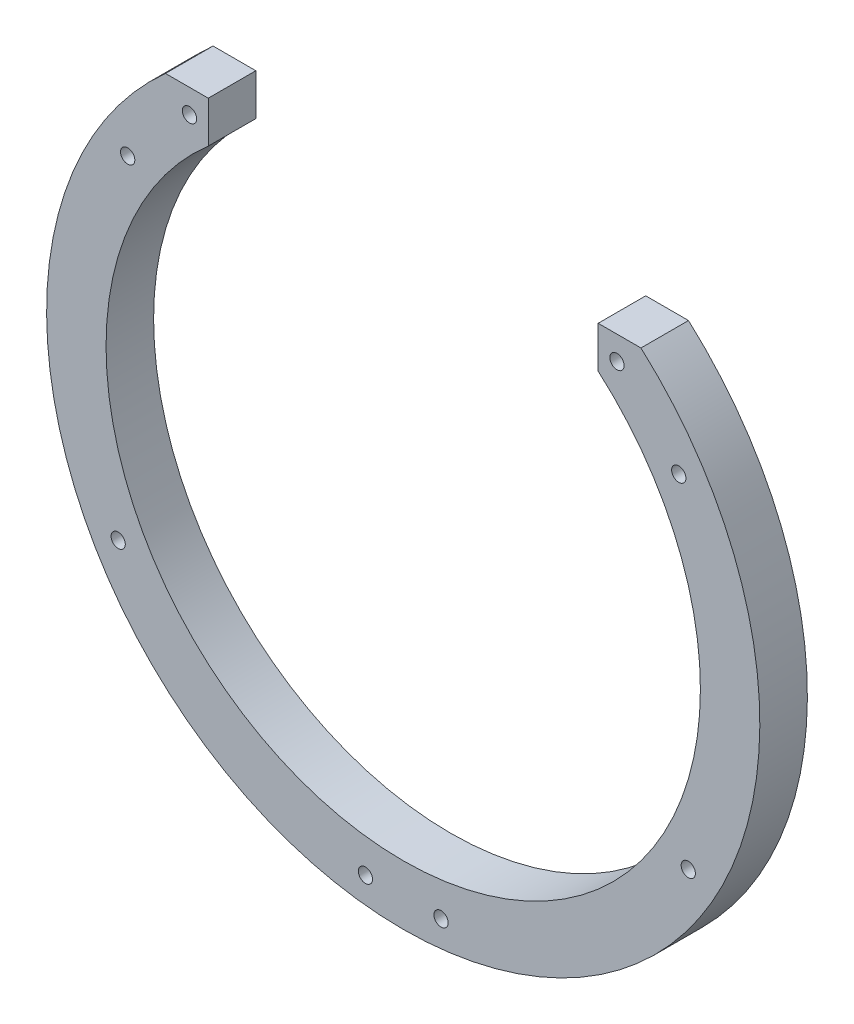
ISO-10303-21;
HEADER;
FILE_DESCRIPTION(('STEP AP214'),'2;1');
FILE_NAME('part.step','',(''),(''),'','','');
FILE_SCHEMA(('AUTOMOTIVE_DESIGN { 1 0 10303 214 1 1 1 1 }'));
ENDSEC;
DATA;
#1=APPLICATION_CONTEXT('core data for automotive mechanical design processes');
#2=APPLICATION_PROTOCOL_DEFINITION('international standard','automotive_design',2000,#1);
#3=PRODUCT_CONTEXT('',#1,'mechanical');
#4=PRODUCT('Part','Part','',(#3));
#5=PRODUCT_RELATED_PRODUCT_CATEGORY('part','',(#4));
#6=PRODUCT_DEFINITION_FORMATION('','',#4);
#7=PRODUCT_DEFINITION_CONTEXT('part definition',#1,'design');
#8=PRODUCT_DEFINITION('design','',#6,#7);
#9=PRODUCT_DEFINITION_SHAPE('','',#8);
#10=(LENGTH_UNIT() NAMED_UNIT(*) SI_UNIT(.MILLI.,.METRE.));
#11=(NAMED_UNIT(*) PLANE_ANGLE_UNIT() SI_UNIT($,.RADIAN.));
#12=(NAMED_UNIT(*) SI_UNIT($,.STERADIAN.) SOLID_ANGLE_UNIT());
#13=UNCERTAINTY_MEASURE_WITH_UNIT(LENGTH_MEASURE(1.E-05),#10,'distance_accuracy_value','');
#14=(GEOMETRIC_REPRESENTATION_CONTEXT(3) GLOBAL_UNCERTAINTY_ASSIGNED_CONTEXT((#13)) GLOBAL_UNIT_ASSIGNED_CONTEXT((#10,
#11,#12)) REPRESENTATION_CONTEXT('',''));
#15=CARTESIAN_POINT('',(0.,0.,0.));
#16=DIRECTION('',(0.,0.,1.));
#17=DIRECTION('',(1.,0.,0.));
#18=AXIS2_PLACEMENT_3D('',#15,#16,#17);
#19=CARTESIAN_POINT('',(-33.4554442576326,-168.430491325062,10.));
#20=DIRECTION('',(0.,-1.,0.));
#21=DIRECTION('',(0.,0.,-1.));
#22=AXIS2_PLACEMENT_3D('',#19,#20,#21);
#23=PLANE('',#22);
#24=DIRECTION('',(-1.,0.,0.));
#25=VECTOR('',#24,1.);
#26=CARTESIAN_POINT('',(-33.4554442576326,-168.430491325062,10.));
#27=LINE('',#26,#25);
#28=CARTESIAN_POINT('',(-46.5045945388852,-168.430491325062,10.));
#29=VERTEX_POINT('',#28);
#30=CARTESIAN_POINT('',(-55.5045945388852,-168.430491325062,10.));
#31=VERTEX_POINT('',#30);
#32=EDGE_CURVE('E99',#29,#31,#27,.T.);
#33=ORIENTED_EDGE('',*,*,#32,.F.);
#34=DIRECTION('',(0.,0.,-1.));
#35=VECTOR('',#34,1.);
#36=CARTESIAN_POINT('',(-46.5045945388852,-168.430491325062,10.));
#37=LINE('',#36,#35);
#38=CARTESIAN_POINT('',(-46.5045945388852,-168.430491325062,0.));
#39=VERTEX_POINT('',#38);
#40=EDGE_CURVE('E85',#29,#39,#37,.T.);
#41=ORIENTED_EDGE('',*,*,#40,.T.);
#42=DIRECTION('',(-1.,0.,0.));
#43=VECTOR('',#42,1.);
#44=CARTESIAN_POINT('',(-33.4554442576326,-168.430491325062,0.));
#45=LINE('',#44,#43);
#46=CARTESIAN_POINT('',(-55.5045945388852,-168.430491325062,0.));
#47=VERTEX_POINT('',#46);
#48=EDGE_CURVE('E124',#39,#47,#45,.T.);
#49=ORIENTED_EDGE('',*,*,#48,.T.);
#50=DIRECTION('',(0.,0.,-1.));
#51=VECTOR('',#50,1.);
#52=CARTESIAN_POINT('',(-55.5045945388852,-168.430491325062,10.));
#53=LINE('',#52,#51);
#54=EDGE_CURVE('E107',#31,#47,#53,.T.);
#55=ORIENTED_EDGE('',*,*,#54,.F.);
#56=EDGE_LOOP('',(#33,#41,#49,#55));
#57=FACE_BOUND('',#56,.T.);
#58=ADVANCED_FACE('F36',(#57),#23,.F.);
#59=CARTESIAN_POINT('',(-5.50459453888519,-224.332190762557,10.));
#60=DIRECTION('',(0.,0.,-1.));
#61=DIRECTION('',(-1.,0.,0.));
#62=AXIS2_PLACEMENT_3D('',#59,#60,#61);
#63=CYLINDRICAL_SURFACE('',#62,75.);
#64=CARTESIAN_POINT('',(-5.50459453888519,-224.332190762557,0.));
#65=DIRECTION('',(0.,0.,1.));
#66=DIRECTION('',(1.,0.,0.));
#67=AXIS2_PLACEMENT_3D('',#64,#65,#66);
#68=CIRCLE('',#67,75.);
#69=CARTESIAN_POINT('',(44.4954054611148,-168.430491325062,0.));
#70=VERTEX_POINT('',#69);
#71=EDGE_CURVE('E126',#47,#70,#68,.T.);
#72=ORIENTED_EDGE('',*,*,#71,.T.);
#73=DIRECTION('',(0.,0.,-1.));
#74=VECTOR('',#73,1.);
#75=CARTESIAN_POINT('',(44.4954054611148,-168.430491325062,10.));
#76=LINE('',#75,#74);
#77=CARTESIAN_POINT('',(44.4954054611148,-168.430491325062,10.));
#78=VERTEX_POINT('',#77);
#79=EDGE_CURVE('E123',#78,#70,#76,.T.);
#80=ORIENTED_EDGE('',*,*,#79,.F.);
#81=CARTESIAN_POINT('',(-5.50459453888519,-224.332190762557,10.));
#82=DIRECTION('',(0.,0.,1.));
#83=DIRECTION('',(1.,0.,0.));
#84=AXIS2_PLACEMENT_3D('',#81,#82,#83);
#85=CIRCLE('',#84,75.);
#86=EDGE_CURVE('E108',#31,#78,#85,.T.);
#87=ORIENTED_EDGE('',*,*,#86,.F.);
#88=ORIENTED_EDGE('',*,*,#54,.T.);
#89=EDGE_LOOP('',(#72,#80,#87,#88));
#90=FACE_BOUND('',#89,.T.);
#91=ADVANCED_FACE('F205',(#90),#63,.T.);
#92=CARTESIAN_POINT('',(44.4954054611148,-168.430491325062,10.));
#93=DIRECTION('',(0.,-1.,0.));
#94=DIRECTION('',(0.,0.,-1.));
#95=AXIS2_PLACEMENT_3D('',#92,#93,#94);
#96=PLANE('',#95);
#97=DIRECTION('',(-1.,0.,0.));
#98=VECTOR('',#97,1.);
#99=CARTESIAN_POINT('',(44.4954054611148,-168.430491325062,0.));
#100=LINE('',#99,#98);
#101=CARTESIAN_POINT('',(35.4954054611148,-168.430491325062,0.));
#102=VERTEX_POINT('',#101);
#103=EDGE_CURVE('E114',#70,#102,#100,.T.);
#104=ORIENTED_EDGE('',*,*,#103,.T.);
#105=DIRECTION('',(0.,0.,1.));
#106=VECTOR('',#105,1.);
#107=CARTESIAN_POINT('',(35.4954054611148,-168.430491325062,10.));
#108=LINE('',#107,#106);
#109=CARTESIAN_POINT('',(35.4954054611148,-168.430491325062,10.));
#110=VERTEX_POINT('',#109);
#111=EDGE_CURVE('E50',#102,#110,#108,.T.);
#112=ORIENTED_EDGE('',*,*,#111,.T.);
#113=DIRECTION('',(-1.,0.,0.));
#114=VECTOR('',#113,1.);
#115=CARTESIAN_POINT('',(44.4954054611148,-168.430491325062,10.));
#116=LINE('',#115,#114);
#117=EDGE_CURVE('E111',#78,#110,#116,.T.);
#118=ORIENTED_EDGE('',*,*,#117,.F.);
#119=ORIENTED_EDGE('',*,*,#79,.T.);
#120=EDGE_LOOP('',(#104,#112,#118,#119));
#121=FACE_BOUND('',#120,.T.);
#122=ADVANCED_FACE('F201',(#121),#96,.F.);
#123=CARTESIAN_POINT('',(-5.50459453888519,-224.332190762557,10.));
#124=DIRECTION('',(0.,0.,-1.));
#125=DIRECTION('',(-1.,0.,0.));
#126=AXIS2_PLACEMENT_3D('',#123,#124,#125);
#127=CYLINDRICAL_SURFACE('',#126,62.5);
#128=DIRECTION('',(0.,0.,-1.));
#129=VECTOR('',#128,1.);
#130=CARTESIAN_POINT('',(35.4954054611148,-177.159635182008,10.));
#131=LINE('',#130,#129);
#132=CARTESIAN_POINT('',(35.4954054611148,-177.159635182008,0.));
#133=VERTEX_POINT('',#132);
#134=CARTESIAN_POINT('',(35.4954054611148,-177.159635182008,10.));
#135=VERTEX_POINT('',#134);
#136=EDGE_CURVE('E92',#133,#135,#131,.F.);
#137=ORIENTED_EDGE('',*,*,#136,.F.);
#138=CARTESIAN_POINT('',(-5.50459453888519,-224.332190762557,0.));
#139=DIRECTION('',(0.,0.,1.));
#140=DIRECTION('',(1.,0.,0.));
#141=AXIS2_PLACEMENT_3D('',#138,#139,#140);
#142=CIRCLE('',#141,62.5);
#143=CARTESIAN_POINT('',(-46.5045945388852,-177.159635182008,0.));
#144=VERTEX_POINT('',#143);
#145=EDGE_CURVE('E109',#144,#133,#142,.T.);
#146=ORIENTED_EDGE('',*,*,#145,.F.);
#147=DIRECTION('',(0.,0.,-1.));
#148=VECTOR('',#147,1.);
#149=CARTESIAN_POINT('',(-46.5045945388852,-177.159635182008,10.));
#150=LINE('',#149,#148);
#151=CARTESIAN_POINT('',(-46.5045945388852,-177.159635182008,10.));
#152=VERTEX_POINT('',#151);
#153=EDGE_CURVE('E57',#152,#144,#150,.T.);
#154=ORIENTED_EDGE('',*,*,#153,.F.);
#155=CARTESIAN_POINT('',(-5.50459453888519,-224.332190762557,10.));
#156=DIRECTION('',(0.,0.,1.));
#157=DIRECTION('',(1.,0.,0.));
#158=AXIS2_PLACEMENT_3D('',#155,#156,#157);
#159=CIRCLE('',#158,62.5);
#160=EDGE_CURVE('E102',#152,#135,#159,.T.);
#161=ORIENTED_EDGE('',*,*,#160,.T.);
#162=EDGE_LOOP('',(#137,#146,#154,#161));
#163=FACE_BOUND('',#162,.T.);
#164=ADVANCED_FACE('F139',(#163),#127,.F.);
#165=CARTESIAN_POINT('',(-5.50459453888519,-224.332190762557,10.));
#166=DIRECTION('',(0.,0.,1.));
#167=DIRECTION('',(1.,0.,0.));
#168=AXIS2_PLACEMENT_3D('',#165,#166,#167);
#169=PLANE('',#168);
#170=DIRECTION('',(0.,1.,0.));
#171=VECTOR('',#170,1.);
#172=CARTESIAN_POINT('',(35.4954054611148,-180.832416365489,10.));
#173=LINE('',#172,#171);
#174=EDGE_CURVE('E103',#135,#110,#173,.T.);
#175=ORIENTED_EDGE('',*,*,#174,.F.);
#176=ORIENTED_EDGE('',*,*,#160,.F.);
#177=DIRECTION('',(0.,-1.,0.));
#178=VECTOR('',#177,1.);
#179=CARTESIAN_POINT('',(-46.5045945388852,-180.832416365489,10.));
#180=LINE('',#179,#178);
#181=EDGE_CURVE('E88',#29,#152,#180,.T.);
#182=ORIENTED_EDGE('',*,*,#181,.F.);
#183=ORIENTED_EDGE('',*,*,#32,.T.);
#184=ORIENTED_EDGE('',*,*,#86,.T.);
#185=ORIENTED_EDGE('',*,*,#117,.T.);
#186=EDGE_LOOP('',(#175,#176,#182,#183,#184,#185));
#187=FACE_BOUND('',#186,.T.);
#188=CARTESIAN_POINT('',(-50.4554442576325,-173.430491325062,10.));
#189=DIRECTION('',(0.,0.,1.));
#190=DIRECTION('',(-1.,0.,0.));
#191=AXIS2_PLACEMENT_3D('',#188,#189,#190);
#192=CIRCLE('',#191,1.5);
#193=CARTESIAN_POINT('',(-51.9554442576325,-173.430491325062,10.));
#194=VERTEX_POINT('',#193);
#195=EDGE_CURVE('E141',#194,#194,#192,.T.);
#196=ORIENTED_EDGE('',*,*,#195,.F.);
#197=EDGE_LOOP('',(#196));
#198=FACE_BOUND('',#197,.T.);
#199=CARTESIAN_POINT('',(-63.4554442576325,-187.430491325062,10.));
#200=DIRECTION('',(0.,0.,1.));
#201=DIRECTION('',(-1.,0.,0.));
#202=AXIS2_PLACEMENT_3D('',#199,#200,#201);
#203=CIRCLE('',#202,1.50000000000001);
#204=CARTESIAN_POINT('',(-64.9554442576325,-187.430491325062,10.));
#205=VERTEX_POINT('',#204);
#206=EDGE_CURVE('E161',#205,#205,#203,.T.);
#207=ORIENTED_EDGE('',*,*,#206,.F.);
#208=EDGE_LOOP('',(#207));
#209=FACE_BOUND('',#208,.T.);
#210=CARTESIAN_POINT('',(-65.4554442576326,-258.430491325062,10.));
#211=DIRECTION('',(0.,0.,1.));
#212=DIRECTION('',(-1.,0.,0.));
#213=AXIS2_PLACEMENT_3D('',#210,#211,#212);
#214=CIRCLE('',#213,1.50000000000001);
#215=CARTESIAN_POINT('',(-66.9554442576326,-258.430491325062,10.));
#216=VERTEX_POINT('',#215);
#217=EDGE_CURVE('E155',#216,#216,#214,.T.);
#218=ORIENTED_EDGE('',*,*,#217,.F.);
#219=EDGE_LOOP('',(#218));
#220=FACE_BOUND('',#219,.T.);
#221=CARTESIAN_POINT('',(2.4462551798622,-293.430491325062,10.));
#222=DIRECTION('',(0.,0.,1.));
#223=DIRECTION('',(1.,0.,0.));
#224=AXIS2_PLACEMENT_3D('',#221,#222,#223);
#225=CIRCLE('',#224,1.5);
#226=CARTESIAN_POINT('',(3.9462551798622,-293.430491325062,10.));
#227=VERTEX_POINT('',#226);
#228=EDGE_CURVE('E149',#227,#227,#225,.T.);
#229=ORIENTED_EDGE('',*,*,#228,.F.);
#230=EDGE_LOOP('',(#229));
#231=FACE_BOUND('',#230,.T.);
#232=CARTESIAN_POINT('',(-13.4554442576326,-293.430491325062,10.));
#233=DIRECTION('',(0.,0.,1.));
#234=DIRECTION('',(-1.,0.,0.));
#235=AXIS2_PLACEMENT_3D('',#232,#233,#234);
#236=CIRCLE('',#235,1.5);
#237=CARTESIAN_POINT('',(-14.9554442576326,-293.430491325062,10.));
#238=VERTEX_POINT('',#237);
#239=EDGE_CURVE('E148',#238,#238,#236,.T.);
#240=ORIENTED_EDGE('',*,*,#239,.F.);
#241=EDGE_LOOP('',(#240));
#242=FACE_BOUND('',#241,.T.);
#243=CARTESIAN_POINT('',(54.4462551798622,-258.430491325062,10.));
#244=DIRECTION('',(0.,0.,1.));
#245=DIRECTION('',(1.,0.,0.));
#246=AXIS2_PLACEMENT_3D('',#243,#244,#245);
#247=CIRCLE('',#246,1.5);
#248=CARTESIAN_POINT('',(55.9462551798622,-258.430491325062,10.));
#249=VERTEX_POINT('',#248);
#250=EDGE_CURVE('E178',#249,#249,#247,.T.);
#251=ORIENTED_EDGE('',*,*,#250,.F.);
#252=EDGE_LOOP('',(#251));
#253=FACE_BOUND('',#252,.T.);
#254=CARTESIAN_POINT('',(52.4462551798622,-187.430491325062,10.));
#255=DIRECTION('',(0.,0.,1.));
#256=DIRECTION('',(1.,0.,0.));
#257=AXIS2_PLACEMENT_3D('',#254,#255,#256);
#258=CIRCLE('',#257,1.5);
#259=CARTESIAN_POINT('',(53.9462551798622,-187.430491325062,10.));
#260=VERTEX_POINT('',#259);
#261=EDGE_CURVE('E172',#260,#260,#258,.T.);
#262=ORIENTED_EDGE('',*,*,#261,.F.);
#263=EDGE_LOOP('',(#262));
#264=FACE_BOUND('',#263,.T.);
#265=CARTESIAN_POINT('',(39.4462551798622,-173.430491325062,10.));
#266=DIRECTION('',(0.,0.,1.));
#267=DIRECTION('',(1.,0.,0.));
#268=AXIS2_PLACEMENT_3D('',#265,#266,#267);
#269=CIRCLE('',#268,1.5);
#270=CARTESIAN_POINT('',(40.9462551798622,-173.430491325062,10.));
#271=VERTEX_POINT('',#270);
#272=EDGE_CURVE('E117',#271,#271,#269,.T.);
#273=ORIENTED_EDGE('',*,*,#272,.F.);
#274=EDGE_LOOP('',(#273));
#275=FACE_BOUND('',#274,.T.);
#276=ADVANCED_FACE('F97',(#187,#198,#209,#220,#231,#242,#253,#264,#275),#169,.T.);
#277=CARTESIAN_POINT('',(-5.50459453888519,-224.332190762557,0.));
#278=DIRECTION('',(0.,0.,1.));
#279=DIRECTION('',(1.,0.,0.));
#280=AXIS2_PLACEMENT_3D('',#277,#278,#279);
#281=PLANE('',#280);
#282=CARTESIAN_POINT('',(-50.4554442576325,-173.430491325062,0.));
#283=DIRECTION('',(0.,0.,1.));
#284=DIRECTION('',(-1.,0.,0.));
#285=AXIS2_PLACEMENT_3D('',#282,#283,#284);
#286=CIRCLE('',#285,1.5);
#287=CARTESIAN_POINT('',(-51.9554442576325,-173.430491325062,0.));
#288=VERTEX_POINT('',#287);
#289=EDGE_CURVE('E164',#288,#288,#286,.T.);
#290=ORIENTED_EDGE('',*,*,#289,.T.);
#291=EDGE_LOOP('',(#290));
#292=FACE_BOUND('',#291,.T.);
#293=CARTESIAN_POINT('',(-63.4554442576325,-187.430491325062,0.));
#294=DIRECTION('',(0.,0.,1.));
#295=DIRECTION('',(-1.,0.,0.));
#296=AXIS2_PLACEMENT_3D('',#293,#294,#295);
#297=CIRCLE('',#296,1.50000000000001);
#298=CARTESIAN_POINT('',(-64.9554442576325,-187.430491325062,0.));
#299=VERTEX_POINT('',#298);
#300=EDGE_CURVE('E158',#299,#299,#297,.T.);
#301=ORIENTED_EDGE('',*,*,#300,.T.);
#302=EDGE_LOOP('',(#301));
#303=FACE_BOUND('',#302,.T.);
#304=CARTESIAN_POINT('',(-65.4554442576326,-258.430491325062,0.));
#305=DIRECTION('',(0.,0.,1.));
#306=DIRECTION('',(-1.,0.,0.));
#307=AXIS2_PLACEMENT_3D('',#304,#305,#306);
#308=CIRCLE('',#307,1.50000000000001);
#309=CARTESIAN_POINT('',(-66.9554442576326,-258.430491325062,0.));
#310=VERTEX_POINT('',#309);
#311=EDGE_CURVE('E152',#310,#310,#308,.T.);
#312=ORIENTED_EDGE('',*,*,#311,.T.);
#313=EDGE_LOOP('',(#312));
#314=FACE_BOUND('',#313,.T.);
#315=CARTESIAN_POINT('',(2.4462551798622,-293.430491325062,0.));
#316=DIRECTION('',(0.,0.,1.));
#317=DIRECTION('',(1.,0.,0.));
#318=AXIS2_PLACEMENT_3D('',#315,#316,#317);
#319=CIRCLE('',#318,1.5);
#320=CARTESIAN_POINT('',(3.9462551798622,-293.430491325062,0.));
#321=VERTEX_POINT('',#320);
#322=EDGE_CURVE('E145',#321,#321,#319,.T.);
#323=ORIENTED_EDGE('',*,*,#322,.T.);
#324=EDGE_LOOP('',(#323));
#325=FACE_BOUND('',#324,.T.);
#326=CARTESIAN_POINT('',(-13.4554442576326,-293.430491325062,0.));
#327=DIRECTION('',(0.,0.,1.));
#328=DIRECTION('',(-1.,0.,0.));
#329=AXIS2_PLACEMENT_3D('',#326,#327,#328);
#330=CIRCLE('',#329,1.5);
#331=CARTESIAN_POINT('',(-14.9554442576326,-293.430491325062,0.));
#332=VERTEX_POINT('',#331);
#333=EDGE_CURVE('E181',#332,#332,#330,.T.);
#334=ORIENTED_EDGE('',*,*,#333,.T.);
#335=EDGE_LOOP('',(#334));
#336=FACE_BOUND('',#335,.T.);
#337=CARTESIAN_POINT('',(54.4462551798622,-258.430491325062,0.));
#338=DIRECTION('',(0.,0.,1.));
#339=DIRECTION('',(1.,0.,0.));
#340=AXIS2_PLACEMENT_3D('',#337,#338,#339);
#341=CIRCLE('',#340,1.5);
#342=CARTESIAN_POINT('',(55.9462551798622,-258.430491325062,0.));
#343=VERTEX_POINT('',#342);
#344=EDGE_CURVE('E175',#343,#343,#341,.T.);
#345=ORIENTED_EDGE('',*,*,#344,.T.);
#346=EDGE_LOOP('',(#345));
#347=FACE_BOUND('',#346,.T.);
#348=CARTESIAN_POINT('',(52.4462551798622,-187.430491325062,0.));
#349=DIRECTION('',(0.,0.,1.));
#350=DIRECTION('',(1.,0.,0.));
#351=AXIS2_PLACEMENT_3D('',#348,#349,#350);
#352=CIRCLE('',#351,1.5);
#353=CARTESIAN_POINT('',(53.9462551798622,-187.430491325062,0.));
#354=VERTEX_POINT('',#353);
#355=EDGE_CURVE('E169',#354,#354,#352,.T.);
#356=ORIENTED_EDGE('',*,*,#355,.T.);
#357=EDGE_LOOP('',(#356));
#358=FACE_BOUND('',#357,.T.);
#359=CARTESIAN_POINT('',(39.4462551798622,-173.430491325062,0.));
#360=DIRECTION('',(0.,0.,1.));
#361=DIRECTION('',(1.,0.,0.));
#362=AXIS2_PLACEMENT_3D('',#359,#360,#361);
#363=CIRCLE('',#362,1.5);
#364=CARTESIAN_POINT('',(40.9462551798622,-173.430491325062,0.));
#365=VERTEX_POINT('',#364);
#366=EDGE_CURVE('E127',#365,#365,#363,.T.);
#367=ORIENTED_EDGE('',*,*,#366,.T.);
#368=EDGE_LOOP('',(#367));
#369=FACE_BOUND('',#368,.T.);
#370=ORIENTED_EDGE('',*,*,#145,.T.);
#371=DIRECTION('',(0.,1.,0.));
#372=VECTOR('',#371,1.);
#373=CARTESIAN_POINT('',(35.4954054611148,-224.332190762557,0.));
#374=LINE('',#373,#372);
#375=EDGE_CURVE('E11',#133,#102,#374,.T.);
#376=ORIENTED_EDGE('',*,*,#375,.T.);
#377=ORIENTED_EDGE('',*,*,#103,.F.);
#378=ORIENTED_EDGE('',*,*,#71,.F.);
#379=ORIENTED_EDGE('',*,*,#48,.F.);
#380=DIRECTION('',(0.,-1.,0.));
#381=VECTOR('',#380,1.);
#382=CARTESIAN_POINT('',(-46.5045945388852,-224.332190762557,0.));
#383=LINE('',#382,#381);
#384=EDGE_CURVE('E43',#39,#144,#383,.T.);
#385=ORIENTED_EDGE('',*,*,#384,.T.);
#386=EDGE_LOOP('',(#370,#376,#377,#378,#379,#385));
#387=FACE_BOUND('',#386,.T.);
#388=ADVANCED_FACE('F135',(#292,#303,#314,#325,#336,#347,#358,#369,#387),#281,.F.);
#389=CARTESIAN_POINT('',(39.4462551798622,-173.430491325062,0.));
#390=DIRECTION('',(0.,0.,1.));
#391=DIRECTION('',(1.,0.,0.));
#392=AXIS2_PLACEMENT_3D('',#389,#390,#391);
#393=CYLINDRICAL_SURFACE('',#392,1.5);
#394=ORIENTED_EDGE('',*,*,#366,.F.);
#395=EDGE_LOOP('',(#394));
#396=FACE_BOUND('',#395,.T.);
#397=ORIENTED_EDGE('',*,*,#272,.T.);
#398=EDGE_LOOP('',(#397));
#399=FACE_BOUND('',#398,.T.);
#400=ADVANCED_FACE('F191',(#396,#399),#393,.F.);
#401=CARTESIAN_POINT('',(52.4462551798622,-187.430491325062,0.));
#402=DIRECTION('',(0.,0.,1.));
#403=DIRECTION('',(1.,0.,0.));
#404=AXIS2_PLACEMENT_3D('',#401,#402,#403);
#405=CYLINDRICAL_SURFACE('',#404,1.5);
#406=ORIENTED_EDGE('',*,*,#355,.F.);
#407=EDGE_LOOP('',(#406));
#408=FACE_BOUND('',#407,.T.);
#409=ORIENTED_EDGE('',*,*,#261,.T.);
#410=EDGE_LOOP('',(#409));
#411=FACE_BOUND('',#410,.T.);
#412=ADVANCED_FACE('F243',(#408,#411),#405,.F.);
#413=CARTESIAN_POINT('',(54.4462551798622,-258.430491325062,0.));
#414=DIRECTION('',(0.,0.,1.));
#415=DIRECTION('',(1.,0.,0.));
#416=AXIS2_PLACEMENT_3D('',#413,#414,#415);
#417=CYLINDRICAL_SURFACE('',#416,1.5);
#418=ORIENTED_EDGE('',*,*,#344,.F.);
#419=EDGE_LOOP('',(#418));
#420=FACE_BOUND('',#419,.T.);
#421=ORIENTED_EDGE('',*,*,#250,.T.);
#422=EDGE_LOOP('',(#421));
#423=FACE_BOUND('',#422,.T.);
#424=ADVANCED_FACE('F246',(#420,#423),#417,.F.);
#425=CARTESIAN_POINT('',(-13.4554442576326,-293.430491325062,0.));
#426=DIRECTION('',(0.,0.,1.));
#427=DIRECTION('',(1.,0.,0.));
#428=AXIS2_PLACEMENT_3D('',#425,#426,#427);
#429=CYLINDRICAL_SURFACE('',#428,1.5);
#430=ORIENTED_EDGE('',*,*,#333,.F.);
#431=EDGE_LOOP('',(#430));
#432=FACE_BOUND('',#431,.T.);
#433=ORIENTED_EDGE('',*,*,#239,.T.);
#434=EDGE_LOOP('',(#433));
#435=FACE_BOUND('',#434,.T.);
#436=ADVANCED_FACE('F231',(#432,#435),#429,.F.);
#437=CARTESIAN_POINT('',(2.4462551798622,-293.430491325062,0.));
#438=DIRECTION('',(0.,0.,1.));
#439=DIRECTION('',(1.,0.,0.));
#440=AXIS2_PLACEMENT_3D('',#437,#438,#439);
#441=CYLINDRICAL_SURFACE('',#440,1.5);
#442=ORIENTED_EDGE('',*,*,#322,.F.);
#443=EDGE_LOOP('',(#442));
#444=FACE_BOUND('',#443,.T.);
#445=ORIENTED_EDGE('',*,*,#228,.T.);
#446=EDGE_LOOP('',(#445));
#447=FACE_BOUND('',#446,.T.);
#448=ADVANCED_FACE('F227',(#444,#447),#441,.F.);
#449=CARTESIAN_POINT('',(-65.4554442576326,-258.430491325062,0.));
#450=DIRECTION('',(0.,0.,1.));
#451=DIRECTION('',(1.,0.,0.));
#452=AXIS2_PLACEMENT_3D('',#449,#450,#451);
#453=CYLINDRICAL_SURFACE('',#452,1.50000000000001);
#454=ORIENTED_EDGE('',*,*,#311,.F.);
#455=EDGE_LOOP('',(#454));
#456=FACE_BOUND('',#455,.T.);
#457=ORIENTED_EDGE('',*,*,#217,.T.);
#458=EDGE_LOOP('',(#457));
#459=FACE_BOUND('',#458,.T.);
#460=ADVANCED_FACE('F230',(#456,#459),#453,.F.);
#461=CARTESIAN_POINT('',(-63.4554442576325,-187.430491325062,0.));
#462=DIRECTION('',(0.,0.,1.));
#463=DIRECTION('',(1.,0.,0.));
#464=AXIS2_PLACEMENT_3D('',#461,#462,#463);
#465=CYLINDRICAL_SURFACE('',#464,1.50000000000001);
#466=ORIENTED_EDGE('',*,*,#300,.F.);
#467=EDGE_LOOP('',(#466));
#468=FACE_BOUND('',#467,.T.);
#469=ORIENTED_EDGE('',*,*,#206,.T.);
#470=EDGE_LOOP('',(#469));
#471=FACE_BOUND('',#470,.T.);
#472=ADVANCED_FACE('F235',(#468,#471),#465,.F.);
#473=CARTESIAN_POINT('',(-50.4554442576325,-173.430491325062,0.));
#474=DIRECTION('',(0.,0.,1.));
#475=DIRECTION('',(1.,0.,0.));
#476=AXIS2_PLACEMENT_3D('',#473,#474,#475);
#477=CYLINDRICAL_SURFACE('',#476,1.5);
#478=ORIENTED_EDGE('',*,*,#289,.F.);
#479=EDGE_LOOP('',(#478));
#480=FACE_BOUND('',#479,.T.);
#481=ORIENTED_EDGE('',*,*,#195,.T.);
#482=EDGE_LOOP('',(#481));
#483=FACE_BOUND('',#482,.T.);
#484=ADVANCED_FACE('F224',(#480,#483),#477,.F.);
#485=CARTESIAN_POINT('',(-46.5045945388852,-180.832416365489,0.));
#486=DIRECTION('',(-1.,0.,0.));
#487=DIRECTION('',(0.,0.,1.));
#488=AXIS2_PLACEMENT_3D('',#485,#486,#487);
#489=PLANE('',#488);
#490=ORIENTED_EDGE('',*,*,#181,.T.);
#491=ORIENTED_EDGE('',*,*,#153,.T.);
#492=ORIENTED_EDGE('',*,*,#384,.F.);
#493=ORIENTED_EDGE('',*,*,#40,.F.);
#494=EDGE_LOOP('',(#490,#491,#492,#493));
#495=FACE_BOUND('',#494,.T.);
#496=ADVANCED_FACE('F87',(#495),#489,.F.);
#497=CARTESIAN_POINT('',(35.4954054611148,-180.832416365489,0.));
#498=DIRECTION('',(1.,0.,0.));
#499=DIRECTION('',(0.,0.,-1.));
#500=AXIS2_PLACEMENT_3D('',#497,#498,#499);
#501=PLANE('',#500);
#502=ORIENTED_EDGE('',*,*,#375,.F.);
#503=ORIENTED_EDGE('',*,*,#136,.T.);
#504=ORIENTED_EDGE('',*,*,#174,.T.);
#505=ORIENTED_EDGE('',*,*,#111,.F.);
#506=EDGE_LOOP('',(#502,#503,#504,#505));
#507=FACE_BOUND('',#506,.T.);
#508=ADVANCED_FACE('F218',(#507),#501,.F.);
#509=CLOSED_SHELL('',(#58,#91,#122,#164,#276,#388,#400,#412,#424,#436,#448,#460,#472,#484,#496,#508));
#510=MANIFOLD_SOLID_BREP('B2',#509);
#511=ADVANCED_BREP_SHAPE_REPRESENTATION('',(#18,#510),#14);
#512=SHAPE_DEFINITION_REPRESENTATION(#9,#511);
ENDSEC;
END-ISO-10303-21;
